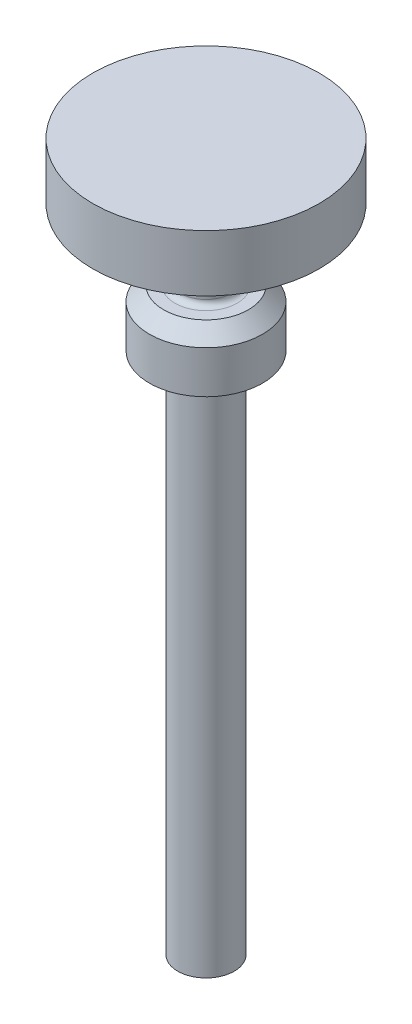
ISO-10303-21;
HEADER;
FILE_DESCRIPTION(('STEP AP214'),'2;1');
FILE_NAME('part.step','',(''),(''),'','','');
FILE_SCHEMA(('AUTOMOTIVE_DESIGN { 1 0 10303 214 1 1 1 1 }'));
ENDSEC;
DATA;
#1=APPLICATION_CONTEXT('core data for automotive mechanical design processes');
#2=APPLICATION_PROTOCOL_DEFINITION('international standard','automotive_design',2000,#1);
#3=PRODUCT_CONTEXT('',#1,'mechanical');
#4=PRODUCT('Part','Part','',(#3));
#5=PRODUCT_RELATED_PRODUCT_CATEGORY('part','',(#4));
#6=PRODUCT_DEFINITION_FORMATION('','',#4);
#7=PRODUCT_DEFINITION_CONTEXT('part definition',#1,'design');
#8=PRODUCT_DEFINITION('design','',#6,#7);
#9=PRODUCT_DEFINITION_SHAPE('','',#8);
#10=(LENGTH_UNIT() NAMED_UNIT(*) SI_UNIT(.MILLI.,.METRE.));
#11=(NAMED_UNIT(*) PLANE_ANGLE_UNIT() SI_UNIT($,.RADIAN.));
#12=(NAMED_UNIT(*) SI_UNIT($,.STERADIAN.) SOLID_ANGLE_UNIT());
#13=UNCERTAINTY_MEASURE_WITH_UNIT(LENGTH_MEASURE(1.E-05),#10,'distance_accuracy_value','');
#14=(GEOMETRIC_REPRESENTATION_CONTEXT(3) GLOBAL_UNCERTAINTY_ASSIGNED_CONTEXT((#13)) GLOBAL_UNIT_ASSIGNED_CONTEXT((#10,
#11,#12)) REPRESENTATION_CONTEXT('',''));
#15=CARTESIAN_POINT('',(0.,0.,0.));
#16=DIRECTION('',(0.,0.,1.));
#17=DIRECTION('',(1.,0.,0.));
#18=AXIS2_PLACEMENT_3D('',#15,#16,#17);
#19=CARTESIAN_POINT('',(1.,0.,0.));
#20=DIRECTION('',(0.,-1.,0.));
#21=DIRECTION('',(0.,0.,-1.));
#22=AXIS2_PLACEMENT_3D('',#19,#20,#21);
#23=PLANE('',#22);
#24=CARTESIAN_POINT('',(0.,0.,0.));
#25=DIRECTION('',(0.,-1.,0.));
#26=DIRECTION('',(0.,0.,-1.));
#27=AXIS2_PLACEMENT_3D('',#24,#25,#26);
#28=CIRCLE('',#27,1.);
#29=CARTESIAN_POINT('',(0.,0.,-1.));
#30=VERTEX_POINT('',#29);
#31=EDGE_CURVE('E91',#30,#30,#28,.T.);
#32=ORIENTED_EDGE('',*,*,#31,.T.);
#33=EDGE_LOOP('',(#32));
#34=FACE_BOUND('',#33,.T.);
#35=ADVANCED_FACE('F39',(#34),#23,.T.);
#36=CARTESIAN_POINT('',(0.,25.,0.));
#37=DIRECTION('',(0.,1.,0.));
#38=DIRECTION('',(0.,0.,1.));
#39=AXIS2_PLACEMENT_3D('',#36,#37,#38);
#40=PLANE('',#39);
#41=CARTESIAN_POINT('',(0.,25.,0.));
#42=DIRECTION('',(0.,-1.,0.));
#43=DIRECTION('',(0.,0.,-1.));
#44=AXIS2_PLACEMENT_3D('',#41,#42,#43);
#45=CIRCLE('',#44,4.);
#46=CARTESIAN_POINT('',(0.,25.,-4.));
#47=VERTEX_POINT('',#46);
#48=EDGE_CURVE('E79',#47,#47,#45,.T.);
#49=ORIENTED_EDGE('',*,*,#48,.F.);
#50=EDGE_LOOP('',(#49));
#51=FACE_BOUND('',#50,.T.);
#52=ADVANCED_FACE('F114',(#51),#40,.T.);
#53=CARTESIAN_POINT('',(0.,0.,0.));
#54=DIRECTION('',(0.,-1.,0.));
#55=DIRECTION('',(0.,0.,-1.));
#56=AXIS2_PLACEMENT_3D('',#53,#54,#55);
#57=CYLINDRICAL_SURFACE('',#56,4.);
#58=ORIENTED_EDGE('',*,*,#48,.T.);
#59=EDGE_LOOP('',(#58));
#60=FACE_BOUND('',#59,.T.);
#61=CARTESIAN_POINT('',(0.,23.,0.));
#62=DIRECTION('',(0.,-1.,0.));
#63=DIRECTION('',(0.,0.,-1.));
#64=AXIS2_PLACEMENT_3D('',#61,#62,#63);
#65=CIRCLE('',#64,4.);
#66=CARTESIAN_POINT('',(0.,23.,-4.));
#67=VERTEX_POINT('',#66);
#68=EDGE_CURVE('E83',#67,#67,#65,.T.);
#69=ORIENTED_EDGE('',*,*,#68,.F.);
#70=EDGE_LOOP('',(#69));
#71=FACE_BOUND('',#70,.T.);
#72=ADVANCED_FACE('F119',(#60,#71),#57,.T.);
#73=CARTESIAN_POINT('',(4.,23.,0.));
#74=DIRECTION('',(0.,-1.,0.));
#75=DIRECTION('',(0.,0.,-1.));
#76=AXIS2_PLACEMENT_3D('',#73,#74,#75);
#77=PLANE('',#76);
#78=CARTESIAN_POINT('',(0.,23.,0.));
#79=DIRECTION('',(0.,-1.,0.));
#80=DIRECTION('',(0.,0.,-1.));
#81=AXIS2_PLACEMENT_3D('',#78,#79,#80);
#82=CIRCLE('',#81,1.1);
#83=CARTESIAN_POINT('',(0.,23.,-1.1));
#84=VERTEX_POINT('',#83);
#85=EDGE_CURVE('E10',#84,#84,#82,.F.);
#86=ORIENTED_EDGE('',*,*,#85,.T.);
#87=EDGE_LOOP('',(#86));
#88=FACE_BOUND('',#87,.T.);
#89=ORIENTED_EDGE('',*,*,#68,.T.);
#90=EDGE_LOOP('',(#89));
#91=FACE_BOUND('',#90,.T.);
#92=ADVANCED_FACE('F158',(#88,#91),#77,.T.);
#93=CARTESIAN_POINT('',(0.,0.,0.));
#94=DIRECTION('',(0.,-1.,0.));
#95=DIRECTION('',(0.,0.,-1.));
#96=AXIS2_PLACEMENT_3D('',#93,#94,#95);
#97=CYLINDRICAL_SURFACE('',#96,0.9);
#98=CARTESIAN_POINT('',(0.,20.7,0.));
#99=DIRECTION('',(0.,1.,0.));
#100=DIRECTION('',(0.,0.,1.));
#101=AXIS2_PLACEMENT_3D('',#98,#99,#100);
#102=CIRCLE('',#101,0.9);
#103=CARTESIAN_POINT('',(0.,20.7,0.9));
#104=VERTEX_POINT('',#103);
#105=EDGE_CURVE('E47',#104,#104,#102,.T.);
#106=ORIENTED_EDGE('',*,*,#105,.T.);
#107=EDGE_LOOP('',(#106));
#108=FACE_BOUND('',#107,.T.);
#109=CARTESIAN_POINT('',(0.,22.8,0.));
#110=DIRECTION('',(0.,-1.,0.));
#111=DIRECTION('',(0.,0.,-1.));
#112=AXIS2_PLACEMENT_3D('',#109,#110,#111);
#113=CIRCLE('',#112,0.9);
#114=CARTESIAN_POINT('',(0.,22.8,-0.9));
#115=VERTEX_POINT('',#114);
#116=EDGE_CURVE('E52',#115,#115,#113,.T.);
#117=ORIENTED_EDGE('',*,*,#116,.T.);
#118=EDGE_LOOP('',(#117));
#119=FACE_BOUND('',#118,.T.);
#120=ADVANCED_FACE('F142',(#108,#119),#97,.T.);
#121=CARTESIAN_POINT('',(0.9,20.5,0.));
#122=DIRECTION('',(0.,1.,0.));
#123=DIRECTION('',(0.,0.,1.));
#124=AXIS2_PLACEMENT_3D('',#121,#122,#123);
#125=PLANE('',#124);
#126=CARTESIAN_POINT('',(0.,20.5,0.));
#127=DIRECTION('',(0.,1.,0.));
#128=DIRECTION('',(0.,0.,1.));
#129=AXIS2_PLACEMENT_3D('',#126,#127,#128);
#130=CIRCLE('',#129,1.1);
#131=CARTESIAN_POINT('',(0.,20.5,1.1));
#132=VERTEX_POINT('',#131);
#133=EDGE_CURVE('E57',#132,#132,#130,.F.);
#134=ORIENTED_EDGE('',*,*,#133,.T.);
#135=EDGE_LOOP('',(#134));
#136=FACE_BOUND('',#135,.T.);
#137=CARTESIAN_POINT('',(0.,20.5,0.));
#138=DIRECTION('',(0.,1.,0.));
#139=DIRECTION('',(0.,0.,1.));
#140=AXIS2_PLACEMENT_3D('',#137,#138,#139);
#141=CIRCLE('',#140,1.5);
#142=CARTESIAN_POINT('',(0.,20.5,1.5));
#143=VERTEX_POINT('',#142);
#144=EDGE_CURVE('E71',#143,#143,#141,.T.);
#145=ORIENTED_EDGE('',*,*,#144,.T.);
#146=EDGE_LOOP('',(#145));
#147=FACE_BOUND('',#146,.T.);
#148=ADVANCED_FACE('F139',(#136,#147),#125,.T.);
#149=CARTESIAN_POINT('',(0.,0.,0.));
#150=DIRECTION('',(0.,-1.,0.));
#151=DIRECTION('',(0.,0.,-1.));
#152=AXIS2_PLACEMENT_3D('',#149,#150,#151);
#153=CYLINDRICAL_SURFACE('',#152,2.);
#154=CARTESIAN_POINT('',(0.,20.,0.));
#155=DIRECTION('',(0.,1.,0.));
#156=DIRECTION('',(0.,0.,1.));
#157=AXIS2_PLACEMENT_3D('',#154,#155,#156);
#158=CIRCLE('',#157,2.);
#159=CARTESIAN_POINT('',(0.,20.,2.));
#160=VERTEX_POINT('',#159);
#161=EDGE_CURVE('E75',#160,#160,#158,.F.);
#162=ORIENTED_EDGE('',*,*,#161,.T.);
#163=EDGE_LOOP('',(#162));
#164=FACE_BOUND('',#163,.T.);
#165=CARTESIAN_POINT('',(0.,18.5,0.));
#166=DIRECTION('',(0.,-1.,0.));
#167=DIRECTION('',(0.,0.,-1.));
#168=AXIS2_PLACEMENT_3D('',#165,#166,#167);
#169=CIRCLE('',#168,2.);
#170=CARTESIAN_POINT('',(0.,18.5,-2.));
#171=VERTEX_POINT('',#170);
#172=EDGE_CURVE('E87',#171,#171,#169,.T.);
#173=ORIENTED_EDGE('',*,*,#172,.F.);
#174=EDGE_LOOP('',(#173));
#175=FACE_BOUND('',#174,.T.);
#176=ADVANCED_FACE('F110',(#164,#175),#153,.T.);
#177=CARTESIAN_POINT('',(2.,18.5,0.));
#178=DIRECTION('',(0.,-1.,0.));
#179=DIRECTION('',(0.,0.,-1.));
#180=AXIS2_PLACEMENT_3D('',#177,#178,#179);
#181=PLANE('',#180);
#182=CARTESIAN_POINT('',(0.,18.5,0.));
#183=DIRECTION('',(0.,-1.,0.));
#184=DIRECTION('',(0.,0.,-1.));
#185=AXIS2_PLACEMENT_3D('',#182,#183,#184);
#186=CIRCLE('',#185,1.2);
#187=CARTESIAN_POINT('',(0.,18.5,-1.2));
#188=VERTEX_POINT('',#187);
#189=EDGE_CURVE('E63',#188,#188,#186,.F.);
#190=ORIENTED_EDGE('',*,*,#189,.T.);
#191=EDGE_LOOP('',(#190));
#192=FACE_BOUND('',#191,.T.);
#193=ORIENTED_EDGE('',*,*,#172,.T.);
#194=EDGE_LOOP('',(#193));
#195=FACE_BOUND('',#194,.T.);
#196=ADVANCED_FACE('F100',(#192,#195),#181,.T.);
#197=CARTESIAN_POINT('',(0.,0.,0.));
#198=DIRECTION('',(0.,-1.,0.));
#199=DIRECTION('',(0.,0.,-1.));
#200=AXIS2_PLACEMENT_3D('',#197,#198,#199);
#201=CYLINDRICAL_SURFACE('',#200,0.999999999999999);
#202=CARTESIAN_POINT('',(0.,18.3,0.));
#203=DIRECTION('',(0.,-1.,0.));
#204=DIRECTION('',(0.,0.,-1.));
#205=AXIS2_PLACEMENT_3D('',#202,#203,#204);
#206=CIRCLE('',#205,0.999999999999999);
#207=CARTESIAN_POINT('',(0.,18.3,-0.999999999999999));
#208=VERTEX_POINT('',#207);
#209=EDGE_CURVE('E67',#208,#208,#206,.T.);
#210=ORIENTED_EDGE('',*,*,#209,.T.);
#211=EDGE_LOOP('',(#210));
#212=FACE_BOUND('',#211,.T.);
#213=ORIENTED_EDGE('',*,*,#31,.F.);
#214=EDGE_LOOP('',(#213));
#215=FACE_BOUND('',#214,.T.);
#216=ADVANCED_FACE('F97',(#212,#215),#201,.T.);
#217=CARTESIAN_POINT('',(0.,20.,0.));
#218=DIRECTION('',(0.,-1.,0.));
#219=DIRECTION('',(0.,0.,-1.));
#220=AXIS2_PLACEMENT_3D('',#217,#218,#219);
#221=CONICAL_SURFACE('',#220,2.,0.785398163397457);
#222=ORIENTED_EDGE('',*,*,#144,.F.);
#223=EDGE_LOOP('',(#222));
#224=FACE_BOUND('',#223,.T.);
#225=ORIENTED_EDGE('',*,*,#161,.F.);
#226=EDGE_LOOP('',(#225));
#227=FACE_BOUND('',#226,.T.);
#228=ADVANCED_FACE('F99',(#224,#227),#221,.T.);
#229=CARTESIAN_POINT('',(0.,18.3,0.));
#230=DIRECTION('',(0.,-1.,0.));
#231=DIRECTION('',(0.,0.,-1.));
#232=AXIS2_PLACEMENT_3D('',#229,#230,#231);
#233=TOROIDAL_SURFACE('',#232,1.2,0.2);
#234=ORIENTED_EDGE('',*,*,#189,.F.);
#235=EDGE_LOOP('',(#234));
#236=FACE_BOUND('',#235,.T.);
#237=ORIENTED_EDGE('',*,*,#209,.F.);
#238=EDGE_LOOP('',(#237));
#239=FACE_BOUND('',#238,.T.);
#240=ADVANCED_FACE('F107',(#236,#239),#233,.F.);
#241=CARTESIAN_POINT('',(0.,20.7,0.));
#242=DIRECTION('',(0.,1.,0.));
#243=DIRECTION('',(0.,0.,1.));
#244=AXIS2_PLACEMENT_3D('',#241,#242,#243);
#245=TOROIDAL_SURFACE('',#244,1.1,0.2);
#246=ORIENTED_EDGE('',*,*,#105,.F.);
#247=EDGE_LOOP('',(#246));
#248=FACE_BOUND('',#247,.T.);
#249=ORIENTED_EDGE('',*,*,#133,.F.);
#250=EDGE_LOOP('',(#249));
#251=FACE_BOUND('',#250,.T.);
#252=ADVANCED_FACE('F128',(#248,#251),#245,.F.);
#253=CARTESIAN_POINT('',(0.,22.8,0.));
#254=DIRECTION('',(0.,-1.,0.));
#255=DIRECTION('',(0.,0.,-1.));
#256=AXIS2_PLACEMENT_3D('',#253,#254,#255);
#257=TOROIDAL_SURFACE('',#256,1.1,0.2);
#258=ORIENTED_EDGE('',*,*,#85,.F.);
#259=EDGE_LOOP('',(#258));
#260=FACE_BOUND('',#259,.T.);
#261=ORIENTED_EDGE('',*,*,#116,.F.);
#262=EDGE_LOOP('',(#261));
#263=FACE_BOUND('',#262,.T.);
#264=ADVANCED_FACE('F41',(#260,#263),#257,.F.);
#265=CLOSED_SHELL('',(#35,#52,#72,#92,#120,#148,#176,#196,#216,#228,#240,#252,#264));
#266=MANIFOLD_SOLID_BREP('B2',#265);
#267=ADVANCED_BREP_SHAPE_REPRESENTATION('',(#18,#266),#14);
#268=SHAPE_DEFINITION_REPRESENTATION(#9,#267);
ENDSEC;
END-ISO-10303-21;
